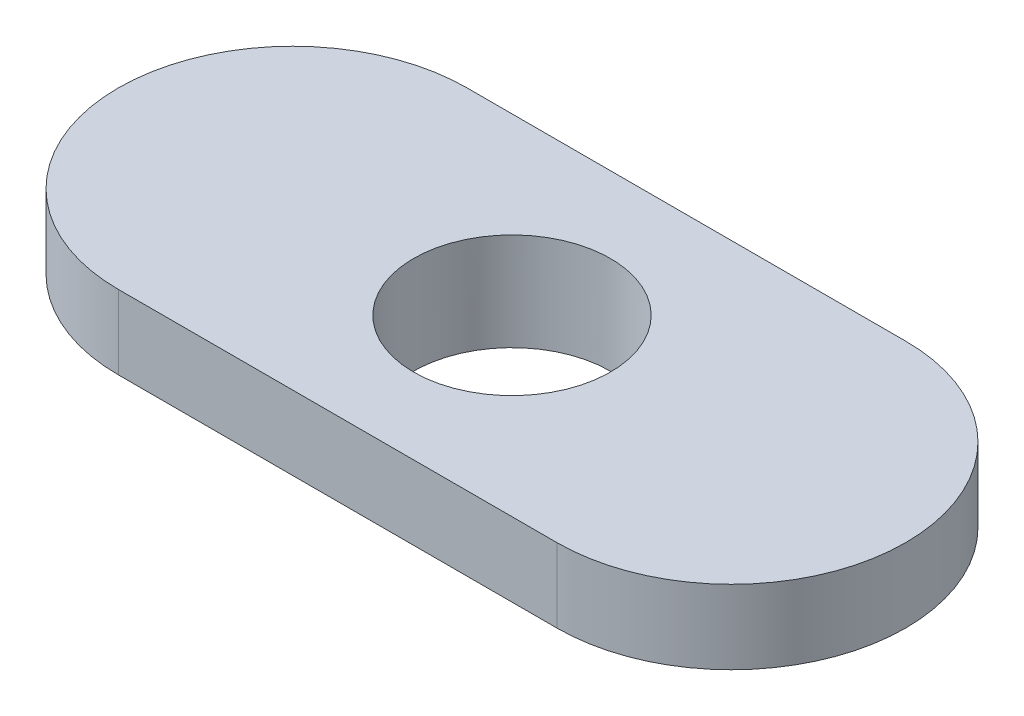
ISO-10303-21;
HEADER;
FILE_DESCRIPTION(('STEP AP214'),'2;1');
FILE_NAME('part.step','',(''),(''),'','','');
FILE_SCHEMA(('AUTOMOTIVE_DESIGN { 1 0 10303 214 1 1 1 1 }'));
ENDSEC;
DATA;
#1=APPLICATION_CONTEXT('core data for automotive mechanical design processes');
#2=APPLICATION_PROTOCOL_DEFINITION('international standard','automotive_design',2000,#1);
#3=PRODUCT_CONTEXT('',#1,'mechanical');
#4=PRODUCT('Part','Part','',(#3));
#5=PRODUCT_RELATED_PRODUCT_CATEGORY('part','',(#4));
#6=PRODUCT_DEFINITION_FORMATION('','',#4);
#7=PRODUCT_DEFINITION_CONTEXT('part definition',#1,'design');
#8=PRODUCT_DEFINITION('design','',#6,#7);
#9=PRODUCT_DEFINITION_SHAPE('','',#8);
#10=(LENGTH_UNIT() NAMED_UNIT(*) SI_UNIT(.MILLI.,.METRE.));
#11=(NAMED_UNIT(*) PLANE_ANGLE_UNIT() SI_UNIT($,.RADIAN.));
#12=(NAMED_UNIT(*) SI_UNIT($,.STERADIAN.) SOLID_ANGLE_UNIT());
#13=UNCERTAINTY_MEASURE_WITH_UNIT(LENGTH_MEASURE(1.E-05),#10,'distance_accuracy_value','');
#14=(GEOMETRIC_REPRESENTATION_CONTEXT(3) GLOBAL_UNCERTAINTY_ASSIGNED_CONTEXT((#13)) GLOBAL_UNIT_ASSIGNED_CONTEXT((#10,
#11,#12)) REPRESENTATION_CONTEXT('',''));
#15=CARTESIAN_POINT('',(0.,0.,0.));
#16=DIRECTION('',(0.,0.,1.));
#17=DIRECTION('',(1.,0.,0.));
#18=AXIS2_PLACEMENT_3D('',#15,#16,#17);
#19=CARTESIAN_POINT('',(-7.0739,-8.7376,0.));
#20=DIRECTION('',(0.,1.,0.));
#21=DIRECTION('',(0.,0.,1.));
#22=AXIS2_PLACEMENT_3D('',#19,#20,#21);
#23=PLANE('',#22);
#24=CARTESIAN_POINT('',(-7.0739,-8.7376,0.));
#25=DIRECTION('',(0.,1.,0.));
#26=DIRECTION('',(0.,0.,1.));
#27=AXIS2_PLACEMENT_3D('',#24,#25,#26);
#28=CIRCLE('',#27,5.6261);
#29=CARTESIAN_POINT('',(-7.0739,-8.7376,-5.6261));
#30=VERTEX_POINT('',#29);
#31=CARTESIAN_POINT('',(-7.0739,-8.7376,5.6261));
#32=VERTEX_POINT('',#31);
#33=EDGE_CURVE('E94',#30,#32,#28,.T.);
#34=ORIENTED_EDGE('',*,*,#33,.F.);
#35=DIRECTION('',(-1.,0.,0.));
#36=VECTOR('',#35,1.);
#37=CARTESIAN_POINT('',(-7.0739,-8.7376,-5.6261));
#38=LINE('',#37,#36);
#39=CARTESIAN_POINT('',(7.0739,-8.7376,-5.6261));
#40=VERTEX_POINT('',#39);
#41=EDGE_CURVE('E91',#40,#30,#38,.T.);
#42=ORIENTED_EDGE('',*,*,#41,.F.);
#43=CARTESIAN_POINT('',(7.0739,-8.7376,0.));
#44=DIRECTION('',(0.,1.,0.));
#45=DIRECTION('',(0.,0.,1.));
#46=AXIS2_PLACEMENT_3D('',#43,#44,#45);
#47=CIRCLE('',#46,5.6261);
#48=CARTESIAN_POINT('',(7.0739,-8.7376,5.6261));
#49=VERTEX_POINT('',#48);
#50=EDGE_CURVE('E83',#49,#40,#47,.T.);
#51=ORIENTED_EDGE('',*,*,#50,.F.);
#52=DIRECTION('',(1.,0.,0.));
#53=VECTOR('',#52,1.);
#54=CARTESIAN_POINT('',(-7.0739,-8.7376,5.6261));
#55=LINE('',#54,#53);
#56=EDGE_CURVE('E90',#32,#49,#55,.T.);
#57=ORIENTED_EDGE('',*,*,#56,.F.);
#58=EDGE_LOOP('',(#34,#42,#51,#57));
#59=FACE_BOUND('',#58,.T.);
#60=CARTESIAN_POINT('',(0.,-8.7376,0.));
#61=DIRECTION('',(0.,1.,0.));
#62=DIRECTION('',(0.,0.,1.));
#63=AXIS2_PLACEMENT_3D('',#60,#61,#62);
#64=CIRCLE('',#63,3.5687);
#65=CARTESIAN_POINT('',(0.,-8.7376,3.5687));
#66=VERTEX_POINT('',#65);
#67=EDGE_CURVE('E11',#66,#66,#64,.F.);
#68=ORIENTED_EDGE('',*,*,#67,.F.);
#69=EDGE_LOOP('',(#68));
#70=FACE_BOUND('',#69,.T.);
#71=ADVANCED_FACE('F33',(#59,#70),#23,.F.);
#72=CARTESIAN_POINT('',(-7.0739,-8.7376,0.));
#73=DIRECTION('',(0.,1.,0.));
#74=DIRECTION('',(0.,0.,1.));
#75=AXIS2_PLACEMENT_3D('',#72,#73,#74);
#76=CYLINDRICAL_SURFACE('',#75,5.6261);
#77=CARTESIAN_POINT('',(-7.0739,-6.35,0.));
#78=DIRECTION('',(0.,1.,0.));
#79=DIRECTION('',(0.,0.,1.));
#80=AXIS2_PLACEMENT_3D('',#77,#78,#79);
#81=CIRCLE('',#80,5.6261);
#82=CARTESIAN_POINT('',(-7.0739,-6.35,-5.6261));
#83=VERTEX_POINT('',#82);
#84=CARTESIAN_POINT('',(-7.0739,-6.35,5.6261));
#85=VERTEX_POINT('',#84);
#86=EDGE_CURVE('E101',#83,#85,#81,.T.);
#87=ORIENTED_EDGE('',*,*,#86,.F.);
#88=DIRECTION('',(0.,1.,0.));
#89=VECTOR('',#88,1.);
#90=CARTESIAN_POINT('',(-7.0739,-8.7376,-5.6261));
#91=LINE('',#90,#89);
#92=EDGE_CURVE('E42',#30,#83,#91,.T.);
#93=ORIENTED_EDGE('',*,*,#92,.F.);
#94=ORIENTED_EDGE('',*,*,#33,.T.);
#95=DIRECTION('',(0.,1.,0.));
#96=VECTOR('',#95,1.);
#97=CARTESIAN_POINT('',(-7.0739,-8.7376,5.6261));
#98=LINE('',#97,#96);
#99=EDGE_CURVE('E77',#32,#85,#98,.T.);
#100=ORIENTED_EDGE('',*,*,#99,.T.);
#101=EDGE_LOOP('',(#87,#93,#94,#100));
#102=FACE_BOUND('',#101,.T.);
#103=ADVANCED_FACE('F35',(#102),#76,.T.);
#104=CARTESIAN_POINT('',(-7.0739,-8.7376,-5.6261));
#105=DIRECTION('',(0.,0.,-1.));
#106=DIRECTION('',(-1.,0.,0.));
#107=AXIS2_PLACEMENT_3D('',#104,#105,#106);
#108=PLANE('',#107);
#109=DIRECTION('',(-1.,0.,0.));
#110=VECTOR('',#109,1.);
#111=CARTESIAN_POINT('',(-7.0739,-6.35,-5.6261));
#112=LINE('',#111,#110);
#113=CARTESIAN_POINT('',(7.0739,-6.35,-5.6261));
#114=VERTEX_POINT('',#113);
#115=EDGE_CURVE('E96',#114,#83,#112,.T.);
#116=ORIENTED_EDGE('',*,*,#115,.F.);
#117=DIRECTION('',(0.,1.,0.));
#118=VECTOR('',#117,1.);
#119=CARTESIAN_POINT('',(7.0739,-8.7376,-5.6261));
#120=LINE('',#119,#118);
#121=EDGE_CURVE('E66',#40,#114,#120,.T.);
#122=ORIENTED_EDGE('',*,*,#121,.F.);
#123=ORIENTED_EDGE('',*,*,#41,.T.);
#124=ORIENTED_EDGE('',*,*,#92,.T.);
#125=EDGE_LOOP('',(#116,#122,#123,#124));
#126=FACE_BOUND('',#125,.T.);
#127=ADVANCED_FACE('F113',(#126),#108,.T.);
#128=CARTESIAN_POINT('',(7.0739,-8.7376,0.));
#129=DIRECTION('',(0.,1.,0.));
#130=DIRECTION('',(0.,0.,1.));
#131=AXIS2_PLACEMENT_3D('',#128,#129,#130);
#132=CYLINDRICAL_SURFACE('',#131,5.6261);
#133=CARTESIAN_POINT('',(7.0739,-6.35,0.));
#134=DIRECTION('',(0.,1.,0.));
#135=DIRECTION('',(0.,0.,1.));
#136=AXIS2_PLACEMENT_3D('',#133,#134,#135);
#137=CIRCLE('',#136,5.6261);
#138=CARTESIAN_POINT('',(7.0739,-6.35,5.6261));
#139=VERTEX_POINT('',#138);
#140=EDGE_CURVE('E85',#139,#114,#137,.T.);
#141=ORIENTED_EDGE('',*,*,#140,.F.);
#142=DIRECTION('',(0.,1.,0.));
#143=VECTOR('',#142,1.);
#144=CARTESIAN_POINT('',(7.0739,-8.7376,5.6261));
#145=LINE('',#144,#143);
#146=EDGE_CURVE('E80',#49,#139,#145,.T.);
#147=ORIENTED_EDGE('',*,*,#146,.F.);
#148=ORIENTED_EDGE('',*,*,#50,.T.);
#149=ORIENTED_EDGE('',*,*,#121,.T.);
#150=EDGE_LOOP('',(#141,#147,#148,#149));
#151=FACE_BOUND('',#150,.T.);
#152=ADVANCED_FACE('F82',(#151),#132,.T.);
#153=CARTESIAN_POINT('',(-7.0739,-8.7376,5.6261));
#154=DIRECTION('',(0.,0.,1.));
#155=DIRECTION('',(1.,0.,0.));
#156=AXIS2_PLACEMENT_3D('',#153,#154,#155);
#157=PLANE('',#156);
#158=DIRECTION('',(1.,0.,0.));
#159=VECTOR('',#158,1.);
#160=CARTESIAN_POINT('',(-7.0739,-6.35,5.6261));
#161=LINE('',#160,#159);
#162=EDGE_CURVE('E104',#85,#139,#161,.T.);
#163=ORIENTED_EDGE('',*,*,#162,.F.);
#164=ORIENTED_EDGE('',*,*,#99,.F.);
#165=ORIENTED_EDGE('',*,*,#56,.T.);
#166=ORIENTED_EDGE('',*,*,#146,.T.);
#167=EDGE_LOOP('',(#163,#164,#165,#166));
#168=FACE_BOUND('',#167,.T.);
#169=ADVANCED_FACE('F93',(#168),#157,.T.);
#170=CARTESIAN_POINT('',(-7.0739,-6.35,0.));
#171=DIRECTION('',(0.,1.,0.));
#172=DIRECTION('',(0.,0.,1.));
#173=AXIS2_PLACEMENT_3D('',#170,#171,#172);
#174=PLANE('',#173);
#175=CARTESIAN_POINT('',(0.,-6.35,0.));
#176=DIRECTION('',(0.,1.,0.));
#177=DIRECTION('',(0.,0.,1.));
#178=AXIS2_PLACEMENT_3D('',#175,#176,#177);
#179=CIRCLE('',#178,3.175);
#180=CARTESIAN_POINT('',(0.,-6.35,3.175));
#181=VERTEX_POINT('',#180);
#182=EDGE_CURVE('E105',#181,#181,#179,.T.);
#183=ORIENTED_EDGE('',*,*,#182,.F.);
#184=EDGE_LOOP('',(#183));
#185=FACE_BOUND('',#184,.T.);
#186=ORIENTED_EDGE('',*,*,#86,.T.);
#187=ORIENTED_EDGE('',*,*,#162,.T.);
#188=ORIENTED_EDGE('',*,*,#140,.T.);
#189=ORIENTED_EDGE('',*,*,#115,.T.);
#190=EDGE_LOOP('',(#186,#187,#188,#189));
#191=FACE_BOUND('',#190,.T.);
#192=ADVANCED_FACE('F112',(#185,#191),#174,.T.);
#193=CARTESIAN_POINT('',(0.,-8.7376,0.));
#194=DIRECTION('',(0.,1.,0.));
#195=DIRECTION('',(0.,0.,1.));
#196=AXIS2_PLACEMENT_3D('',#193,#194,#195);
#197=CYLINDRICAL_SURFACE('',#196,3.175);
#198=ORIENTED_EDGE('',*,*,#182,.T.);
#199=EDGE_LOOP('',(#198));
#200=FACE_BOUND('',#199,.T.);
#201=CARTESIAN_POINT('',(0.,-9.4996,0.));
#202=DIRECTION('',(0.,-1.,0.));
#203=DIRECTION('',(0.,0.,-1.));
#204=AXIS2_PLACEMENT_3D('',#201,#202,#203);
#205=CIRCLE('',#204,3.175);
#206=CARTESIAN_POINT('',(0.,-9.4996,-3.175));
#207=VERTEX_POINT('',#206);
#208=EDGE_CURVE('E141',#207,#207,#205,.T.);
#209=ORIENTED_EDGE('',*,*,#208,.T.);
#210=EDGE_LOOP('',(#209));
#211=FACE_BOUND('',#210,.T.);
#212=ADVANCED_FACE('F127',(#200,#211),#197,.F.);
#213=CARTESIAN_POINT('',(0.,-9.4996,0.));
#214=DIRECTION('',(0.,-1.,0.));
#215=DIRECTION('',(0.,0.,-1.));
#216=AXIS2_PLACEMENT_3D('',#213,#214,#215);
#217=PLANE('',#216);
#218=CARTESIAN_POINT('',(0.,-9.4996,0.));
#219=DIRECTION('',(0.,-1.,0.));
#220=DIRECTION('',(0.,0.,-1.));
#221=AXIS2_PLACEMENT_3D('',#218,#219,#220);
#222=CIRCLE('',#221,3.5687);
#223=CARTESIAN_POINT('',(0.,-9.4996,-3.5687));
#224=VERTEX_POINT('',#223);
#225=EDGE_CURVE('E139',#224,#224,#222,.T.);
#226=ORIENTED_EDGE('',*,*,#225,.T.);
#227=EDGE_LOOP('',(#226));
#228=FACE_BOUND('',#227,.T.);
#229=ORIENTED_EDGE('',*,*,#208,.F.);
#230=EDGE_LOOP('',(#229));
#231=FACE_BOUND('',#230,.T.);
#232=ADVANCED_FACE('F135',(#228,#231),#217,.T.);
#233=CARTESIAN_POINT('',(0.,-9.4996,0.));
#234=DIRECTION('',(0.,1.,0.));
#235=DIRECTION('',(0.,0.,1.));
#236=AXIS2_PLACEMENT_3D('',#233,#234,#235);
#237=CYLINDRICAL_SURFACE('',#236,3.5687);
#238=ORIENTED_EDGE('',*,*,#225,.F.);
#239=EDGE_LOOP('',(#238));
#240=FACE_BOUND('',#239,.T.);
#241=ORIENTED_EDGE('',*,*,#67,.T.);
#242=EDGE_LOOP('',(#241));
#243=FACE_BOUND('',#242,.T.);
#244=ADVANCED_FACE('F149',(#240,#243),#237,.T.);
#245=CLOSED_SHELL('',(#71,#103,#127,#152,#169,#192,#212,#232,#244));
#246=MANIFOLD_SOLID_BREP('B2',#245);
#247=ADVANCED_BREP_SHAPE_REPRESENTATION('',(#18,#246),#14);
#248=SHAPE_DEFINITION_REPRESENTATION(#9,#247);
ENDSEC;
END-ISO-10303-21;
